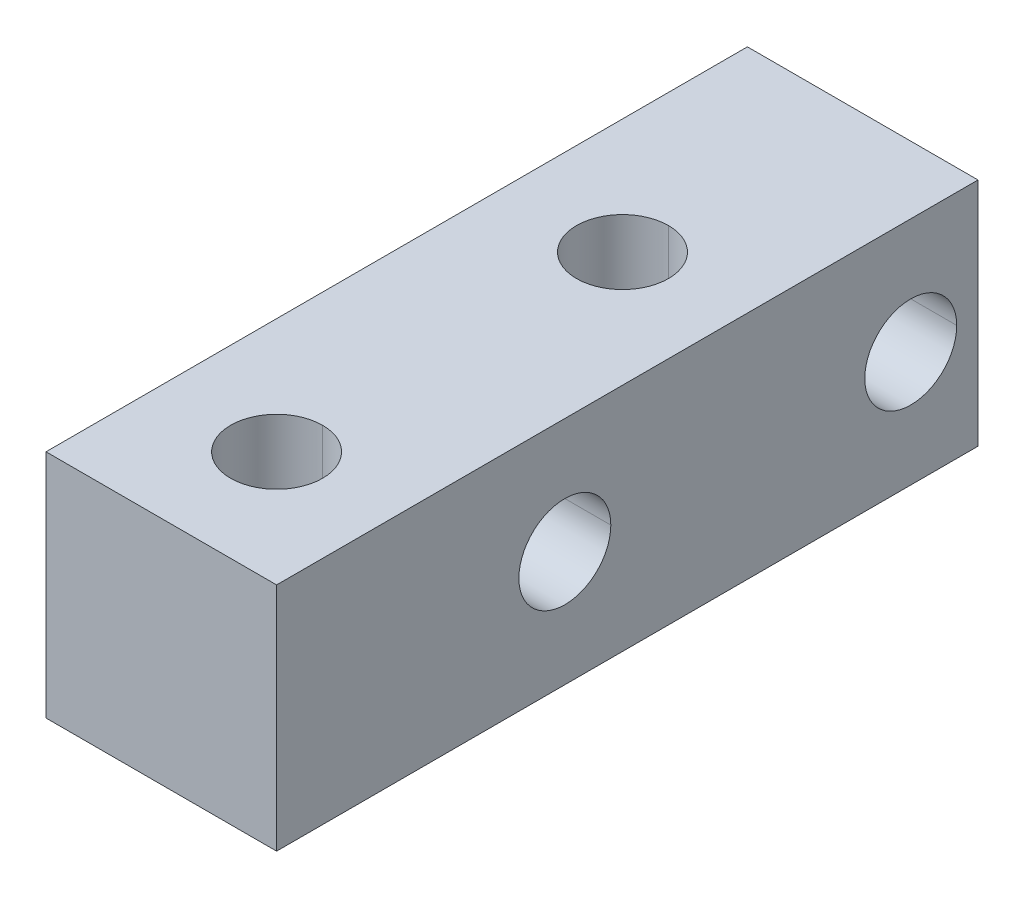
ISO-10303-21;
HEADER;
FILE_DESCRIPTION(('STEP AP214'),'2;1');
FILE_NAME('part.step','',(''),(''),'','','');
FILE_SCHEMA(('AUTOMOTIVE_DESIGN { 1 0 10303 214 1 1 1 1 }'));
ENDSEC;
DATA;
#1=APPLICATION_CONTEXT('core data for automotive mechanical design processes');
#2=APPLICATION_PROTOCOL_DEFINITION('international standard','automotive_design',2000,#1);
#3=PRODUCT_CONTEXT('',#1,'mechanical');
#4=PRODUCT('Part','Part','',(#3));
#5=PRODUCT_RELATED_PRODUCT_CATEGORY('part','',(#4));
#6=PRODUCT_DEFINITION_FORMATION('','',#4);
#7=PRODUCT_DEFINITION_CONTEXT('part definition',#1,'design');
#8=PRODUCT_DEFINITION('design','',#6,#7);
#9=PRODUCT_DEFINITION_SHAPE('','',#8);
#10=(LENGTH_UNIT() NAMED_UNIT(*) SI_UNIT(.MILLI.,.METRE.));
#11=(NAMED_UNIT(*) PLANE_ANGLE_UNIT() SI_UNIT($,.RADIAN.));
#12=(NAMED_UNIT(*) SI_UNIT($,.STERADIAN.) SOLID_ANGLE_UNIT());
#13=UNCERTAINTY_MEASURE_WITH_UNIT(LENGTH_MEASURE(1.E-05),#10,'distance_accuracy_value','');
#14=(GEOMETRIC_REPRESENTATION_CONTEXT(3) GLOBAL_UNCERTAINTY_ASSIGNED_CONTEXT((#13)) GLOBAL_UNIT_ASSIGNED_CONTEXT((#10,
#11,#12)) REPRESENTATION_CONTEXT('',''));
#15=CARTESIAN_POINT('',(0.,0.,0.));
#16=DIRECTION('',(0.,0.,1.));
#17=DIRECTION('',(1.,0.,0.));
#18=AXIS2_PLACEMENT_3D('',#15,#16,#17);
#19=CARTESIAN_POINT('',(4.7625,0.,-26.19375));
#20=DIRECTION('',(1.,0.,0.));
#21=DIRECTION('',(0.,0.,-1.));
#22=AXIS2_PLACEMENT_3D('',#19,#20,#21);
#23=CYLINDRICAL_SURFACE('',#22,1.89865);
#24=DIRECTION('',(1.,0.,0.));
#25=VECTOR('',#24,1.);
#26=CARTESIAN_POINT('',(4.7625,0.,-24.2951));
#27=LINE('',#26,#25);
#28=CARTESIAN_POINT('',(-4.7625,0.,-24.2951));
#29=VERTEX_POINT('',#28);
#30=CARTESIAN_POINT('',(4.7625,0.,-24.2951));
#31=VERTEX_POINT('',#30);
#32=EDGE_CURVE('E227',#29,#31,#27,.T.);
#33=ORIENTED_EDGE('',*,*,#32,.F.);
#34=CARTESIAN_POINT('',(-4.7625,0.,-26.19375));
#35=DIRECTION('',(1.,0.,0.));
#36=DIRECTION('',(0.,0.,-1.));
#37=AXIS2_PLACEMENT_3D('',#34,#35,#36);
#38=CIRCLE('',#37,1.89865);
#39=CARTESIAN_POINT('',(-4.7625,0.,-28.0924));
#40=VERTEX_POINT('',#39);
#41=EDGE_CURVE('E180',#40,#29,#38,.T.);
#42=ORIENTED_EDGE('',*,*,#41,.F.);
#43=DIRECTION('',(1.,0.,0.));
#44=VECTOR('',#43,1.);
#45=CARTESIAN_POINT('',(4.7625,0.,-28.0924));
#46=LINE('',#45,#44);
#47=CARTESIAN_POINT('',(4.7625,0.,-28.0924));
#48=VERTEX_POINT('',#47);
#49=EDGE_CURVE('E235',#40,#48,#46,.T.);
#50=ORIENTED_EDGE('',*,*,#49,.T.);
#51=CARTESIAN_POINT('',(4.7625,0.,-26.19375));
#52=DIRECTION('',(1.,0.,0.));
#53=DIRECTION('',(0.,0.,-1.));
#54=AXIS2_PLACEMENT_3D('',#51,#52,#53);
#55=CIRCLE('',#54,1.89865);
#56=EDGE_CURVE('E215',#48,#31,#55,.T.);
#57=ORIENTED_EDGE('',*,*,#56,.T.);
#58=EDGE_LOOP('',(#33,#42,#50,#57));
#59=FACE_BOUND('',#58,.T.);
#60=ADVANCED_FACE('F48',(#59),#23,.F.);
#61=CARTESIAN_POINT('',(0.,4.7625,-19.05));
#62=DIRECTION('',(0.,1.,0.));
#63=DIRECTION('',(0.,0.,1.));
#64=AXIS2_PLACEMENT_3D('',#61,#62,#63);
#65=CYLINDRICAL_SURFACE('',#64,1.89865);
#66=DIRECTION('',(0.,1.,0.));
#67=VECTOR('',#66,1.);
#68=CARTESIAN_POINT('',(0.,4.7625,-20.94865));
#69=LINE('',#68,#67);
#70=CARTESIAN_POINT('',(0.,-4.7625,-20.94865));
#71=VERTEX_POINT('',#70);
#72=CARTESIAN_POINT('',(0.,4.7625,-20.94865));
#73=VERTEX_POINT('',#72);
#74=EDGE_CURVE('E52',#71,#73,#69,.T.);
#75=ORIENTED_EDGE('',*,*,#74,.F.);
#76=CARTESIAN_POINT('',(0.,-4.7625,-19.05));
#77=DIRECTION('',(0.,1.,0.));
#78=DIRECTION('',(0.,0.,1.));
#79=AXIS2_PLACEMENT_3D('',#76,#77,#78);
#80=CIRCLE('',#79,1.89865);
#81=CARTESIAN_POINT('',(0.,-4.7625,-17.15135));
#82=VERTEX_POINT('',#81);
#83=EDGE_CURVE('E58',#82,#71,#80,.T.);
#84=ORIENTED_EDGE('',*,*,#83,.F.);
#85=DIRECTION('',(0.,1.,0.));
#86=VECTOR('',#85,1.);
#87=CARTESIAN_POINT('',(0.,4.7625,-17.15135));
#88=LINE('',#87,#86);
#89=CARTESIAN_POINT('',(0.,4.7625,-17.15135));
#90=VERTEX_POINT('',#89);
#91=EDGE_CURVE('E193',#82,#90,#88,.T.);
#92=ORIENTED_EDGE('',*,*,#91,.T.);
#93=CARTESIAN_POINT('',(0.,4.7625,-19.05));
#94=DIRECTION('',(0.,1.,0.));
#95=DIRECTION('',(0.,0.,1.));
#96=AXIS2_PLACEMENT_3D('',#93,#94,#95);
#97=CIRCLE('',#96,1.89865);
#98=EDGE_CURVE('E259',#90,#73,#97,.T.);
#99=ORIENTED_EDGE('',*,*,#98,.T.);
#100=EDGE_LOOP('',(#75,#84,#92,#99));
#101=FACE_BOUND('',#100,.T.);
#102=ADVANCED_FACE('F258',(#101),#65,.F.);
#103=CARTESIAN_POINT('',(4.7625,0.,-11.90625));
#104=DIRECTION('',(1.,0.,0.));
#105=DIRECTION('',(0.,0.,-1.));
#106=AXIS2_PLACEMENT_3D('',#103,#104,#105);
#107=CYLINDRICAL_SURFACE('',#106,1.89865);
#108=DIRECTION('',(1.,0.,0.));
#109=VECTOR('',#108,1.);
#110=CARTESIAN_POINT('',(4.7625,0.,-10.0076));
#111=LINE('',#110,#109);
#112=CARTESIAN_POINT('',(-4.7625,0.,-10.0076));
#113=VERTEX_POINT('',#112);
#114=CARTESIAN_POINT('',(4.7625,0.,-10.0076));
#115=VERTEX_POINT('',#114);
#116=EDGE_CURVE('E174',#113,#115,#111,.T.);
#117=ORIENTED_EDGE('',*,*,#116,.F.);
#118=CARTESIAN_POINT('',(-4.7625,0.,-11.90625));
#119=DIRECTION('',(1.,0.,0.));
#120=DIRECTION('',(0.,0.,-1.));
#121=AXIS2_PLACEMENT_3D('',#118,#119,#120);
#122=CIRCLE('',#121,1.89865);
#123=CARTESIAN_POINT('',(-4.7625,0.,-13.8049));
#124=VERTEX_POINT('',#123);
#125=EDGE_CURVE('E168',#124,#113,#122,.T.);
#126=ORIENTED_EDGE('',*,*,#125,.F.);
#127=DIRECTION('',(1.,0.,0.));
#128=VECTOR('',#127,1.);
#129=CARTESIAN_POINT('',(4.7625,0.,-13.8049));
#130=LINE('',#129,#128);
#131=CARTESIAN_POINT('',(4.7625,0.,-13.8049));
#132=VERTEX_POINT('',#131);
#133=EDGE_CURVE('E171',#124,#132,#130,.T.);
#134=ORIENTED_EDGE('',*,*,#133,.T.);
#135=CARTESIAN_POINT('',(4.7625,0.,-11.90625));
#136=DIRECTION('',(1.,0.,0.));
#137=DIRECTION('',(0.,0.,-1.));
#138=AXIS2_PLACEMENT_3D('',#135,#136,#137);
#139=CIRCLE('',#138,1.89865);
#140=EDGE_CURVE('E229',#132,#115,#139,.T.);
#141=ORIENTED_EDGE('',*,*,#140,.T.);
#142=EDGE_LOOP('',(#117,#126,#134,#141));
#143=FACE_BOUND('',#142,.T.);
#144=ADVANCED_FACE('F170',(#143),#107,.F.);
#145=CARTESIAN_POINT('',(0.,4.7625,-4.7625));
#146=DIRECTION('',(0.,1.,0.));
#147=DIRECTION('',(0.,0.,1.));
#148=AXIS2_PLACEMENT_3D('',#145,#146,#147);
#149=CYLINDRICAL_SURFACE('',#148,1.89865);
#150=DIRECTION('',(0.,1.,0.));
#151=VECTOR('',#150,1.);
#152=CARTESIAN_POINT('',(0.,4.7625,-6.66115));
#153=LINE('',#152,#151);
#154=CARTESIAN_POINT('',(0.,-4.7625,-6.66115));
#155=VERTEX_POINT('',#154);
#156=CARTESIAN_POINT('',(0.,4.7625,-6.66115));
#157=VERTEX_POINT('',#156);
#158=EDGE_CURVE('E214',#155,#157,#153,.T.);
#159=ORIENTED_EDGE('',*,*,#158,.F.);
#160=CARTESIAN_POINT('',(0.,-4.7625,-4.7625));
#161=DIRECTION('',(0.,1.,0.));
#162=DIRECTION('',(0.,0.,1.));
#163=AXIS2_PLACEMENT_3D('',#160,#161,#162);
#164=CIRCLE('',#163,1.89865);
#165=CARTESIAN_POINT('',(0.,-4.7625,-2.86385));
#166=VERTEX_POINT('',#165);
#167=EDGE_CURVE('E11',#166,#155,#164,.T.);
#168=ORIENTED_EDGE('',*,*,#167,.F.);
#169=DIRECTION('',(0.,1.,0.));
#170=VECTOR('',#169,1.);
#171=CARTESIAN_POINT('',(0.,4.7625,-2.86385));
#172=LINE('',#171,#170);
#173=CARTESIAN_POINT('',(0.,4.7625,-2.86385));
#174=VERTEX_POINT('',#173);
#175=EDGE_CURVE('E213',#166,#174,#172,.T.);
#176=ORIENTED_EDGE('',*,*,#175,.T.);
#177=CARTESIAN_POINT('',(0.,4.7625,-4.7625));
#178=DIRECTION('',(0.,1.,0.));
#179=DIRECTION('',(0.,0.,1.));
#180=AXIS2_PLACEMENT_3D('',#177,#178,#179);
#181=CIRCLE('',#180,1.89865);
#182=EDGE_CURVE('E142',#174,#157,#181,.T.);
#183=ORIENTED_EDGE('',*,*,#182,.T.);
#184=EDGE_LOOP('',(#159,#168,#176,#183));
#185=FACE_BOUND('',#184,.T.);
#186=ADVANCED_FACE('F305',(#185),#149,.F.);
#187=CARTESIAN_POINT('',(-4.7625,4.7625,0.));
#188=DIRECTION('',(0.,0.,1.));
#189=DIRECTION('',(1.,0.,0.));
#190=AXIS2_PLACEMENT_3D('',#187,#188,#189);
#191=PLANE('',#190);
#192=DIRECTION('',(0.,-1.,0.));
#193=VECTOR('',#192,1.);
#194=CARTESIAN_POINT('',(-4.7625,-4.7625,0.));
#195=LINE('',#194,#193);
#196=CARTESIAN_POINT('',(-4.7625,4.7625,0.));
#197=VERTEX_POINT('',#196);
#198=CARTESIAN_POINT('',(-4.7625,-4.7625,0.));
#199=VERTEX_POINT('',#198);
#200=EDGE_CURVE('E318',#197,#199,#195,.T.);
#201=ORIENTED_EDGE('',*,*,#200,.T.);
#202=DIRECTION('',(1.,0.,0.));
#203=VECTOR('',#202,1.);
#204=CARTESIAN_POINT('',(4.7625,-4.7625,0.));
#205=LINE('',#204,#203);
#206=CARTESIAN_POINT('',(4.7625,-4.7625,0.));
#207=VERTEX_POINT('',#206);
#208=EDGE_CURVE('E232',#199,#207,#205,.T.);
#209=ORIENTED_EDGE('',*,*,#208,.T.);
#210=DIRECTION('',(0.,1.,0.));
#211=VECTOR('',#210,1.);
#212=CARTESIAN_POINT('',(4.7625,-4.7625,0.));
#213=LINE('',#212,#211);
#214=CARTESIAN_POINT('',(4.7625,4.7625,0.));
#215=VERTEX_POINT('',#214);
#216=EDGE_CURVE('E216',#207,#215,#213,.T.);
#217=ORIENTED_EDGE('',*,*,#216,.T.);
#218=DIRECTION('',(-1.,0.,0.));
#219=VECTOR('',#218,1.);
#220=CARTESIAN_POINT('',(4.7625,4.7625,0.));
#221=LINE('',#220,#219);
#222=EDGE_CURVE('E179',#215,#197,#221,.T.);
#223=ORIENTED_EDGE('',*,*,#222,.T.);
#224=EDGE_LOOP('',(#201,#209,#217,#223));
#225=FACE_BOUND('',#224,.T.);
#226=ADVANCED_FACE('F308',(#225),#191,.T.);
#227=CARTESIAN_POINT('',(4.7625,-4.7625,-65.65646));
#228=DIRECTION('',(0.,-1.,0.));
#229=DIRECTION('',(0.,0.,-1.));
#230=AXIS2_PLACEMENT_3D('',#227,#228,#229);
#231=PLANE('',#230);
#232=DIRECTION('',(-1.,0.,0.));
#233=VECTOR('',#232,1.);
#234=CARTESIAN_POINT('',(-4.7625,-4.7625,-28.971875));
#235=LINE('',#234,#233);
#236=CARTESIAN_POINT('',(4.7625,-4.7625,-28.971875));
#237=VERTEX_POINT('',#236);
#238=CARTESIAN_POINT('',(-4.7625,-4.7625,-28.971875));
#239=VERTEX_POINT('',#238);
#240=EDGE_CURVE('E66',#237,#239,#235,.T.);
#241=ORIENTED_EDGE('',*,*,#240,.F.);
#242=DIRECTION('',(0.,0.,1.));
#243=VECTOR('',#242,1.);
#244=CARTESIAN_POINT('',(4.7625,-4.7625,-65.65646));
#245=LINE('',#244,#243);
#246=EDGE_CURVE('E78',#237,#207,#245,.T.);
#247=ORIENTED_EDGE('',*,*,#246,.T.);
#248=ORIENTED_EDGE('',*,*,#208,.F.);
#249=DIRECTION('',(0.,0.,1.));
#250=VECTOR('',#249,1.);
#251=CARTESIAN_POINT('',(-4.7625,-4.7625,-65.65646));
#252=LINE('',#251,#250);
#253=EDGE_CURVE('E324',#239,#199,#252,.T.);
#254=ORIENTED_EDGE('',*,*,#253,.F.);
#255=EDGE_LOOP('',(#241,#247,#248,#254));
#256=FACE_BOUND('',#255,.T.);
#257=ORIENTED_EDGE('',*,*,#167,.T.);
#258=CARTESIAN_POINT('',(0.,-4.7625,-4.7625));
#259=DIRECTION('',(0.,1.,0.));
#260=DIRECTION('',(0.,0.,1.));
#261=AXIS2_PLACEMENT_3D('',#258,#259,#260);
#262=CIRCLE('',#261,1.89865);
#263=EDGE_CURVE('E188',#155,#166,#262,.T.);
#264=ORIENTED_EDGE('',*,*,#263,.T.);
#265=EDGE_LOOP('',(#257,#264));
#266=FACE_BOUND('',#265,.T.);
#267=ORIENTED_EDGE('',*,*,#83,.T.);
#268=CARTESIAN_POINT('',(0.,-4.7625,-19.05));
#269=DIRECTION('',(0.,1.,0.));
#270=DIRECTION('',(0.,0.,1.));
#271=AXIS2_PLACEMENT_3D('',#268,#269,#270);
#272=CIRCLE('',#271,1.89865);
#273=EDGE_CURVE('E239',#71,#82,#272,.T.);
#274=ORIENTED_EDGE('',*,*,#273,.T.);
#275=EDGE_LOOP('',(#267,#274));
#276=FACE_BOUND('',#275,.T.);
#277=ADVANCED_FACE('F276',(#256,#266,#276),#231,.T.);
#278=CARTESIAN_POINT('',(4.7625,-4.7625,-65.65646));
#279=DIRECTION('',(1.,0.,0.));
#280=DIRECTION('',(0.,1.,0.));
#281=AXIS2_PLACEMENT_3D('',#278,#279,#280);
#282=PLANE('',#281);
#283=DIRECTION('',(0.,-1.,0.));
#284=VECTOR('',#283,1.);
#285=CARTESIAN_POINT('',(4.7625,4.7625,-28.971875));
#286=LINE('',#285,#284);
#287=CARTESIAN_POINT('',(4.7625,4.7625,-28.971875));
#288=VERTEX_POINT('',#287);
#289=EDGE_CURVE('E375',#288,#237,#286,.T.);
#290=ORIENTED_EDGE('',*,*,#289,.F.);
#291=DIRECTION('',(0.,0.,1.));
#292=VECTOR('',#291,1.);
#293=CARTESIAN_POINT('',(4.7625,4.7625,-65.65646));
#294=LINE('',#293,#292);
#295=EDGE_CURVE('E262',#288,#215,#294,.T.);
#296=ORIENTED_EDGE('',*,*,#295,.T.);
#297=ORIENTED_EDGE('',*,*,#216,.F.);
#298=ORIENTED_EDGE('',*,*,#246,.F.);
#299=EDGE_LOOP('',(#290,#296,#297,#298));
#300=FACE_BOUND('',#299,.T.);
#301=ORIENTED_EDGE('',*,*,#140,.F.);
#302=CARTESIAN_POINT('',(4.7625,0.,-11.90625));
#303=DIRECTION('',(1.,0.,0.));
#304=DIRECTION('',(0.,0.,-1.));
#305=AXIS2_PLACEMENT_3D('',#302,#303,#304);
#306=CIRCLE('',#305,1.89865);
#307=EDGE_CURVE('E186',#115,#132,#306,.T.);
#308=ORIENTED_EDGE('',*,*,#307,.F.);
#309=EDGE_LOOP('',(#301,#308));
#310=FACE_BOUND('',#309,.T.);
#311=ORIENTED_EDGE('',*,*,#56,.F.);
#312=CARTESIAN_POINT('',(4.7625,0.,-26.19375));
#313=DIRECTION('',(1.,0.,0.));
#314=DIRECTION('',(0.,0.,-1.));
#315=AXIS2_PLACEMENT_3D('',#312,#313,#314);
#316=CIRCLE('',#315,1.89865);
#317=EDGE_CURVE('E240',#31,#48,#316,.T.);
#318=ORIENTED_EDGE('',*,*,#317,.F.);
#319=EDGE_LOOP('',(#311,#318));
#320=FACE_BOUND('',#319,.T.);
#321=ADVANCED_FACE('F266',(#300,#310,#320),#282,.T.);
#322=CARTESIAN_POINT('',(4.7625,4.7625,-65.65646));
#323=DIRECTION('',(0.,1.,0.));
#324=DIRECTION('',(1.,0.,0.));
#325=AXIS2_PLACEMENT_3D('',#322,#323,#324);
#326=PLANE('',#325);
#327=DIRECTION('',(-1.,0.,0.));
#328=VECTOR('',#327,1.);
#329=CARTESIAN_POINT('',(-4.7625,4.7625,-28.971875));
#330=LINE('',#329,#328);
#331=CARTESIAN_POINT('',(-4.7625,4.7625,-28.971875));
#332=VERTEX_POINT('',#331);
#333=EDGE_CURVE('E371',#288,#332,#330,.T.);
#334=ORIENTED_EDGE('',*,*,#333,.T.);
#335=DIRECTION('',(0.,0.,1.));
#336=VECTOR('',#335,1.);
#337=CARTESIAN_POINT('',(-4.7625,4.7625,-65.65646));
#338=LINE('',#337,#336);
#339=EDGE_CURVE('E242',#332,#197,#338,.T.);
#340=ORIENTED_EDGE('',*,*,#339,.T.);
#341=ORIENTED_EDGE('',*,*,#222,.F.);
#342=ORIENTED_EDGE('',*,*,#295,.F.);
#343=EDGE_LOOP('',(#334,#340,#341,#342));
#344=FACE_BOUND('',#343,.T.);
#345=ORIENTED_EDGE('',*,*,#182,.F.);
#346=CARTESIAN_POINT('',(0.,4.7625,-4.7625));
#347=DIRECTION('',(0.,1.,0.));
#348=DIRECTION('',(0.,0.,1.));
#349=AXIS2_PLACEMENT_3D('',#346,#347,#348);
#350=CIRCLE('',#349,1.89865);
#351=EDGE_CURVE('E209',#157,#174,#350,.T.);
#352=ORIENTED_EDGE('',*,*,#351,.F.);
#353=EDGE_LOOP('',(#345,#352));
#354=FACE_BOUND('',#353,.T.);
#355=ORIENTED_EDGE('',*,*,#98,.F.);
#356=CARTESIAN_POINT('',(0.,4.7625,-19.05));
#357=DIRECTION('',(0.,1.,0.));
#358=DIRECTION('',(0.,0.,1.));
#359=AXIS2_PLACEMENT_3D('',#356,#357,#358);
#360=CIRCLE('',#359,1.89865);
#361=EDGE_CURVE('E202',#73,#90,#360,.T.);
#362=ORIENTED_EDGE('',*,*,#361,.F.);
#363=EDGE_LOOP('',(#355,#362));
#364=FACE_BOUND('',#363,.T.);
#365=ADVANCED_FACE('F264',(#344,#354,#364),#326,.T.);
#366=CARTESIAN_POINT('',(-4.7625,-4.7625,-65.65646));
#367=DIRECTION('',(-1.,0.,0.));
#368=DIRECTION('',(0.,0.,1.));
#369=AXIS2_PLACEMENT_3D('',#366,#367,#368);
#370=PLANE('',#369);
#371=DIRECTION('',(0.,-1.,0.));
#372=VECTOR('',#371,1.);
#373=CARTESIAN_POINT('',(-4.7625,4.7625,-28.971875));
#374=LINE('',#373,#372);
#375=EDGE_CURVE('E228',#332,#239,#374,.T.);
#376=ORIENTED_EDGE('',*,*,#375,.T.);
#377=ORIENTED_EDGE('',*,*,#253,.T.);
#378=ORIENTED_EDGE('',*,*,#200,.F.);
#379=ORIENTED_EDGE('',*,*,#339,.F.);
#380=EDGE_LOOP('',(#376,#377,#378,#379));
#381=FACE_BOUND('',#380,.T.);
#382=ORIENTED_EDGE('',*,*,#125,.T.);
#383=CARTESIAN_POINT('',(-4.7625,0.,-11.90625));
#384=DIRECTION('',(1.,0.,0.));
#385=DIRECTION('',(0.,0.,-1.));
#386=AXIS2_PLACEMENT_3D('',#383,#384,#385);
#387=CIRCLE('',#386,1.89865);
#388=EDGE_CURVE('E184',#113,#124,#387,.T.);
#389=ORIENTED_EDGE('',*,*,#388,.T.);
#390=EDGE_LOOP('',(#382,#389));
#391=FACE_BOUND('',#390,.T.);
#392=ORIENTED_EDGE('',*,*,#41,.T.);
#393=CARTESIAN_POINT('',(-4.7625,0.,-26.19375));
#394=DIRECTION('',(1.,0.,0.));
#395=DIRECTION('',(0.,0.,-1.));
#396=AXIS2_PLACEMENT_3D('',#393,#394,#395);
#397=CIRCLE('',#396,1.89865);
#398=EDGE_CURVE('E223',#29,#40,#397,.T.);
#399=ORIENTED_EDGE('',*,*,#398,.T.);
#400=EDGE_LOOP('',(#392,#399));
#401=FACE_BOUND('',#400,.T.);
#402=ADVANCED_FACE('F190',(#381,#391,#401),#370,.T.);
#403=CARTESIAN_POINT('',(0.,4.7625,-4.7625));
#404=DIRECTION('',(0.,1.,0.));
#405=DIRECTION('',(0.,0.,1.));
#406=AXIS2_PLACEMENT_3D('',#403,#404,#405);
#407=CYLINDRICAL_SURFACE('',#406,1.89865);
#408=ORIENTED_EDGE('',*,*,#263,.F.);
#409=ORIENTED_EDGE('',*,*,#158,.T.);
#410=ORIENTED_EDGE('',*,*,#351,.T.);
#411=ORIENTED_EDGE('',*,*,#175,.F.);
#412=EDGE_LOOP('',(#408,#409,#410,#411));
#413=FACE_BOUND('',#412,.T.);
#414=ADVANCED_FACE('F273',(#413),#407,.F.);
#415=CARTESIAN_POINT('',(4.7625,0.,-11.90625));
#416=DIRECTION('',(1.,0.,0.));
#417=DIRECTION('',(0.,0.,-1.));
#418=AXIS2_PLACEMENT_3D('',#415,#416,#417);
#419=CYLINDRICAL_SURFACE('',#418,1.89865);
#420=ORIENTED_EDGE('',*,*,#388,.F.);
#421=ORIENTED_EDGE('',*,*,#116,.T.);
#422=ORIENTED_EDGE('',*,*,#307,.T.);
#423=ORIENTED_EDGE('',*,*,#133,.F.);
#424=EDGE_LOOP('',(#420,#421,#422,#423));
#425=FACE_BOUND('',#424,.T.);
#426=ADVANCED_FACE('F183',(#425),#419,.F.);
#427=CARTESIAN_POINT('',(0.,4.7625,-19.05));
#428=DIRECTION('',(0.,1.,0.));
#429=DIRECTION('',(0.,0.,1.));
#430=AXIS2_PLACEMENT_3D('',#427,#428,#429);
#431=CYLINDRICAL_SURFACE('',#430,1.89865);
#432=ORIENTED_EDGE('',*,*,#273,.F.);
#433=ORIENTED_EDGE('',*,*,#74,.T.);
#434=ORIENTED_EDGE('',*,*,#361,.T.);
#435=ORIENTED_EDGE('',*,*,#91,.F.);
#436=EDGE_LOOP('',(#432,#433,#434,#435));
#437=FACE_BOUND('',#436,.T.);
#438=ADVANCED_FACE('F254',(#437),#431,.F.);
#439=CARTESIAN_POINT('',(4.7625,0.,-26.19375));
#440=DIRECTION('',(1.,0.,0.));
#441=DIRECTION('',(0.,0.,-1.));
#442=AXIS2_PLACEMENT_3D('',#439,#440,#441);
#443=CYLINDRICAL_SURFACE('',#442,1.89865);
#444=ORIENTED_EDGE('',*,*,#398,.F.);
#445=ORIENTED_EDGE('',*,*,#32,.T.);
#446=ORIENTED_EDGE('',*,*,#317,.T.);
#447=ORIENTED_EDGE('',*,*,#49,.F.);
#448=EDGE_LOOP('',(#444,#445,#446,#447));
#449=FACE_BOUND('',#448,.T.);
#450=ADVANCED_FACE('F50',(#449),#443,.F.);
#451=CARTESIAN_POINT('',(-4.7625,4.7625,-28.971875));
#452=DIRECTION('',(0.,0.,1.));
#453=DIRECTION('',(1.,0.,0.));
#454=AXIS2_PLACEMENT_3D('',#451,#452,#453);
#455=PLANE('',#454);
#456=ORIENTED_EDGE('',*,*,#240,.T.);
#457=ORIENTED_EDGE('',*,*,#375,.F.);
#458=ORIENTED_EDGE('',*,*,#333,.F.);
#459=ORIENTED_EDGE('',*,*,#289,.T.);
#460=EDGE_LOOP('',(#456,#457,#458,#459));
#461=FACE_BOUND('',#460,.T.);
#462=ADVANCED_FACE('F297',(#461),#455,.F.);
#463=CLOSED_SHELL('',(#60,#102,#144,#186,#226,#277,#321,#365,#402,#414,#426,#438,#450,#462));
#464=MANIFOLD_SOLID_BREP('B2',#463);
#465=ADVANCED_BREP_SHAPE_REPRESENTATION('',(#18,#464),#14);
#466=SHAPE_DEFINITION_REPRESENTATION(#9,#465);
ENDSEC;
END-ISO-10303-21;
